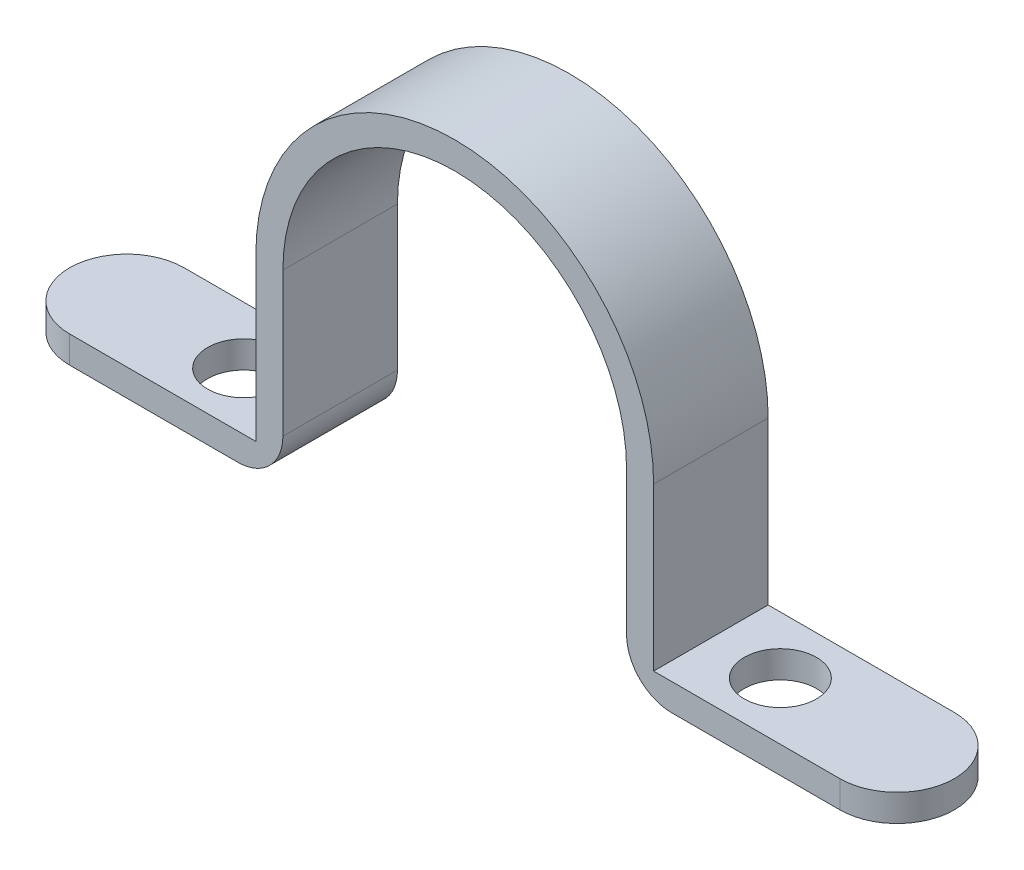
ISO-10303-21;
HEADER;
FILE_DESCRIPTION(('STEP AP214'),'2;1');
FILE_NAME('part.step','',(''),(''),'','','');
FILE_SCHEMA(('AUTOMOTIVE_DESIGN { 1 0 10303 214 1 1 1 1 }'));
ENDSEC;
DATA;
#1=APPLICATION_CONTEXT('core data for automotive mechanical design processes');
#2=APPLICATION_PROTOCOL_DEFINITION('international standard','automotive_design',2000,#1);
#3=PRODUCT_CONTEXT('',#1,'mechanical');
#4=PRODUCT('Part','Part','',(#3));
#5=PRODUCT_RELATED_PRODUCT_CATEGORY('part','',(#4));
#6=PRODUCT_DEFINITION_FORMATION('','',#4);
#7=PRODUCT_DEFINITION_CONTEXT('part definition',#1,'design');
#8=PRODUCT_DEFINITION('design','',#6,#7);
#9=PRODUCT_DEFINITION_SHAPE('','',#8);
#10=(LENGTH_UNIT() NAMED_UNIT(*) SI_UNIT(.MILLI.,.METRE.));
#11=(NAMED_UNIT(*) PLANE_ANGLE_UNIT() SI_UNIT($,.RADIAN.));
#12=(NAMED_UNIT(*) SI_UNIT($,.STERADIAN.) SOLID_ANGLE_UNIT());
#13=UNCERTAINTY_MEASURE_WITH_UNIT(LENGTH_MEASURE(1.E-05),#10,'distance_accuracy_value','');
#14=(GEOMETRIC_REPRESENTATION_CONTEXT(3) GLOBAL_UNCERTAINTY_ASSIGNED_CONTEXT((#13)) GLOBAL_UNIT_ASSIGNED_CONTEXT((#10,
#11,#12)) REPRESENTATION_CONTEXT('',''));
#15=CARTESIAN_POINT('',(0.,0.,0.));
#16=DIRECTION('',(0.,0.,1.));
#17=DIRECTION('',(1.,0.,0.));
#18=AXIS2_PLACEMENT_3D('',#15,#16,#17);
#19=CARTESIAN_POINT('',(46.529017301513,-3.,6.35));
#20=DIRECTION('',(0.,1.,0.));
#21=DIRECTION('',(0.,0.,1.));
#22=AXIS2_PLACEMENT_3D('',#19,#20,#21);
#23=CYLINDRICAL_SURFACE('',#22,6.35);
#24=DIRECTION('',(0.,-1.,0.));
#25=VECTOR('',#24,1.);
#26=CARTESIAN_POINT('',(46.529017301513,-3.,12.7));
#27=LINE('',#26,#25);
#28=CARTESIAN_POINT('',(46.529017301513,-3.,12.7));
#29=VERTEX_POINT('',#28);
#30=CARTESIAN_POINT('',(46.529017301513,0.,12.7));
#31=VERTEX_POINT('',#30);
#32=EDGE_CURVE('E147',#29,#31,#27,.F.);
#33=ORIENTED_EDGE('',*,*,#32,.F.);
#34=CARTESIAN_POINT('',(46.529017301513,-3.,6.35));
#35=DIRECTION('',(0.,1.,0.));
#36=DIRECTION('',(0.,0.,1.));
#37=AXIS2_PLACEMENT_3D('',#34,#35,#36);
#38=CIRCLE('',#37,6.35);
#39=CARTESIAN_POINT('',(46.529017301513,-3.,0.));
#40=VERTEX_POINT('',#39);
#41=EDGE_CURVE('E227',#40,#29,#38,.F.);
#42=ORIENTED_EDGE('',*,*,#41,.F.);
#43=DIRECTION('',(0.,1.,0.));
#44=VECTOR('',#43,1.);
#45=CARTESIAN_POINT('',(46.529017301513,0.,0.));
#46=LINE('',#45,#44);
#47=CARTESIAN_POINT('',(46.529017301513,0.,0.));
#48=VERTEX_POINT('',#47);
#49=EDGE_CURVE('E224',#48,#40,#46,.F.);
#50=ORIENTED_EDGE('',*,*,#49,.F.);
#51=CARTESIAN_POINT('',(46.529017301513,0.,6.35));
#52=DIRECTION('',(0.,-1.,0.));
#53=DIRECTION('',(0.,0.,-1.));
#54=AXIS2_PLACEMENT_3D('',#51,#52,#53);
#55=CIRCLE('',#54,6.35);
#56=EDGE_CURVE('E230',#31,#48,#55,.F.);
#57=ORIENTED_EDGE('',*,*,#56,.F.);
#58=EDGE_LOOP('',(#33,#42,#50,#57));
#59=FACE_BOUND('',#58,.T.);
#60=ADVANCED_FACE('F39',(#59),#23,.T.);
#61=CARTESIAN_POINT('',(-38.870982698487,0.,6.35));
#62=DIRECTION('',(0.,-1.,0.));
#63=DIRECTION('',(0.,0.,-1.));
#64=AXIS2_PLACEMENT_3D('',#61,#62,#63);
#65=CYLINDRICAL_SURFACE('',#64,6.35);
#66=DIRECTION('',(0.,1.,0.));
#67=VECTOR('',#66,1.);
#68=CARTESIAN_POINT('',(-38.870982698487,0.,12.7));
#69=LINE('',#68,#67);
#70=CARTESIAN_POINT('',(-38.870982698487,0.,12.7));
#71=VERTEX_POINT('',#70);
#72=CARTESIAN_POINT('',(-38.870982698487,-3.,12.7));
#73=VERTEX_POINT('',#72);
#74=EDGE_CURVE('E213',#71,#73,#69,.F.);
#75=ORIENTED_EDGE('',*,*,#74,.F.);
#76=CARTESIAN_POINT('',(-38.870982698487,0.,6.35));
#77=DIRECTION('',(0.,-1.,0.));
#78=DIRECTION('',(0.,0.,-1.));
#79=AXIS2_PLACEMENT_3D('',#76,#77,#78);
#80=CIRCLE('',#79,6.35);
#81=CARTESIAN_POINT('',(-38.870982698487,0.,0.));
#82=VERTEX_POINT('',#81);
#83=EDGE_CURVE('E219',#82,#71,#80,.F.);
#84=ORIENTED_EDGE('',*,*,#83,.F.);
#85=DIRECTION('',(0.,-1.,0.));
#86=VECTOR('',#85,1.);
#87=CARTESIAN_POINT('',(-38.870982698487,0.,0.));
#88=LINE('',#87,#86);
#89=CARTESIAN_POINT('',(-38.870982698487,-3.,0.));
#90=VERTEX_POINT('',#89);
#91=EDGE_CURVE('E216',#90,#82,#88,.F.);
#92=ORIENTED_EDGE('',*,*,#91,.F.);
#93=CARTESIAN_POINT('',(-38.870982698487,-3.,6.35));
#94=DIRECTION('',(0.,1.,0.));
#95=DIRECTION('',(0.,0.,1.));
#96=AXIS2_PLACEMENT_3D('',#93,#94,#95);
#97=CIRCLE('',#96,6.35);
#98=EDGE_CURVE('E221',#73,#90,#97,.F.);
#99=ORIENTED_EDGE('',*,*,#98,.F.);
#100=EDGE_LOOP('',(#75,#84,#92,#99));
#101=FACE_BOUND('',#100,.T.);
#102=ADVANCED_FACE('F257',(#101),#65,.T.);
#103=CARTESIAN_POINT('',(3.82901730151295,17.95,12.7));
#104=DIRECTION('',(0.,0.,-1.));
#105=DIRECTION('',(-1.,0.,0.));
#106=AXIS2_PLACEMENT_3D('',#103,#104,#105);
#107=CYLINDRICAL_SURFACE('',#106,22.05);
#108=DIRECTION('',(0.,0.,-1.));
#109=VECTOR('',#108,1.);
#110=CARTESIAN_POINT('',(-18.220982698487,17.95,12.7));
#111=LINE('',#110,#109);
#112=CARTESIAN_POINT('',(-18.220982698487,17.95,12.7));
#113=VERTEX_POINT('',#112);
#114=CARTESIAN_POINT('',(-18.220982698487,17.95,0.));
#115=VERTEX_POINT('',#114);
#116=EDGE_CURVE('E205',#113,#115,#111,.T.);
#117=ORIENTED_EDGE('',*,*,#116,.F.);
#118=CARTESIAN_POINT('',(3.82901730151295,17.95,12.7));
#119=DIRECTION('',(0.,0.,1.));
#120=DIRECTION('',(1.,0.,0.));
#121=AXIS2_PLACEMENT_3D('',#118,#119,#120);
#122=CIRCLE('',#121,22.05);
#123=CARTESIAN_POINT('',(25.879017301513,17.95,12.7));
#124=VERTEX_POINT('',#123);
#125=EDGE_CURVE('E209',#124,#113,#122,.T.);
#126=ORIENTED_EDGE('',*,*,#125,.F.);
#127=DIRECTION('',(0.,0.,-1.));
#128=VECTOR('',#127,1.);
#129=CARTESIAN_POINT('',(25.879017301513,17.95,12.7));
#130=LINE('',#129,#128);
#131=CARTESIAN_POINT('',(25.879017301513,17.95,0.));
#132=VERTEX_POINT('',#131);
#133=EDGE_CURVE('E165',#132,#124,#130,.F.);
#134=ORIENTED_EDGE('',*,*,#133,.F.);
#135=CARTESIAN_POINT('',(3.82901730151295,17.95,0.));
#136=DIRECTION('',(0.,0.,1.));
#137=DIRECTION('',(1.,0.,0.));
#138=AXIS2_PLACEMENT_3D('',#135,#136,#137);
#139=CIRCLE('',#138,22.05);
#140=EDGE_CURVE('E211',#115,#132,#139,.F.);
#141=ORIENTED_EDGE('',*,*,#140,.F.);
#142=EDGE_LOOP('',(#117,#126,#134,#141));
#143=FACE_BOUND('',#142,.T.);
#144=ADVANCED_FACE('F262',(#143),#107,.T.);
#145=CARTESIAN_POINT('',(3.82901730151295,17.95,0.));
#146=DIRECTION('',(0.,0.,-1.));
#147=DIRECTION('',(-1.,0.,0.));
#148=AXIS2_PLACEMENT_3D('',#145,#146,#147);
#149=CYLINDRICAL_SURFACE('',#148,19.05);
#150=DIRECTION('',(0.,0.,1.));
#151=VECTOR('',#150,1.);
#152=CARTESIAN_POINT('',(-15.220982698487,17.95,0.));
#153=LINE('',#152,#151);
#154=CARTESIAN_POINT('',(-15.220982698487,17.95,0.));
#155=VERTEX_POINT('',#154);
#156=CARTESIAN_POINT('',(-15.220982698487,17.95,12.7));
#157=VERTEX_POINT('',#156);
#158=EDGE_CURVE('E159',#155,#157,#153,.T.);
#159=ORIENTED_EDGE('',*,*,#158,.F.);
#160=CARTESIAN_POINT('',(3.82901730151295,17.95,0.));
#161=DIRECTION('',(0.,0.,1.));
#162=DIRECTION('',(1.,0.,0.));
#163=AXIS2_PLACEMENT_3D('',#160,#161,#162);
#164=CIRCLE('',#163,19.05);
#165=CARTESIAN_POINT('',(22.879017301513,17.95,0.));
#166=VERTEX_POINT('',#165);
#167=EDGE_CURVE('E200',#155,#166,#164,.F.);
#168=ORIENTED_EDGE('',*,*,#167,.T.);
#169=DIRECTION('',(0.,0.,1.));
#170=VECTOR('',#169,1.);
#171=CARTESIAN_POINT('',(22.8790173015129,17.95,0.));
#172=LINE('',#171,#170);
#173=CARTESIAN_POINT('',(22.879017301513,17.95,12.7));
#174=VERTEX_POINT('',#173);
#175=EDGE_CURVE('E197',#174,#166,#172,.F.);
#176=ORIENTED_EDGE('',*,*,#175,.F.);
#177=CARTESIAN_POINT('',(3.82901730151295,17.95,12.7));
#178=DIRECTION('',(0.,0.,1.));
#179=DIRECTION('',(1.,0.,0.));
#180=AXIS2_PLACEMENT_3D('',#177,#178,#179);
#181=CIRCLE('',#180,19.05);
#182=EDGE_CURVE('E202',#174,#157,#181,.T.);
#183=ORIENTED_EDGE('',*,*,#182,.T.);
#184=EDGE_LOOP('',(#159,#168,#176,#183));
#185=FACE_BOUND('',#184,.T.);
#186=ADVANCED_FACE('F332',(#185),#149,.F.);
#187=CARTESIAN_POINT('',(-45.220982698487,-3.,12.7));
#188=DIRECTION('',(0.,1.,0.));
#189=DIRECTION('',(0.,0.,1.));
#190=AXIS2_PLACEMENT_3D('',#187,#188,#189);
#191=PLANE('',#190);
#192=CARTESIAN_POINT('',(-25.920982698487,-3.,6.35));
#193=DIRECTION('',(0.,1.,0.));
#194=DIRECTION('',(0.,0.,1.));
#195=AXIS2_PLACEMENT_3D('',#192,#193,#194);
#196=CIRCLE('',#195,4.);
#197=CARTESIAN_POINT('',(-25.920982698487,-3.,10.35));
#198=VERTEX_POINT('',#197);
#199=EDGE_CURVE('E178',#198,#198,#196,.T.);
#200=ORIENTED_EDGE('',*,*,#199,.T.);
#201=EDGE_LOOP('',(#200));
#202=FACE_BOUND('',#201,.T.);
#203=DIRECTION('',(1.,0.,0.));
#204=VECTOR('',#203,1.);
#205=CARTESIAN_POINT('',(-45.220982698487,-3.,0.));
#206=LINE('',#205,#204);
#207=CARTESIAN_POINT('',(-20.220982698487,-3.,0.));
#208=VERTEX_POINT('',#207);
#209=EDGE_CURVE('E174',#90,#208,#206,.T.);
#210=ORIENTED_EDGE('',*,*,#209,.T.);
#211=DIRECTION('',(0.,0.,-1.));
#212=VECTOR('',#211,1.);
#213=CARTESIAN_POINT('',(-20.220982698487,-3.,12.7));
#214=LINE('',#213,#212);
#215=CARTESIAN_POINT('',(-20.220982698487,-3.,12.7));
#216=VERTEX_POINT('',#215);
#217=EDGE_CURVE('E239',#208,#216,#214,.F.);
#218=ORIENTED_EDGE('',*,*,#217,.T.);
#219=DIRECTION('',(1.,0.,0.));
#220=VECTOR('',#219,1.);
#221=CARTESIAN_POINT('',(-45.220982698487,-3.,12.7));
#222=LINE('',#221,#220);
#223=EDGE_CURVE('E192',#73,#216,#222,.T.);
#224=ORIENTED_EDGE('',*,*,#223,.F.);
#225=ORIENTED_EDGE('',*,*,#98,.T.);
#226=EDGE_LOOP('',(#210,#218,#224,#225));
#227=FACE_BOUND('',#226,.T.);
#228=ADVANCED_FACE('F307',(#202,#227),#191,.F.);
#229=CARTESIAN_POINT('',(-15.220982698487,-3.,12.7));
#230=DIRECTION('',(-1.,0.,0.));
#231=DIRECTION('',(0.,0.,1.));
#232=AXIS2_PLACEMENT_3D('',#229,#230,#231);
#233=PLANE('',#232);
#234=DIRECTION('',(0.,1.,0.));
#235=VECTOR('',#234,1.);
#236=CARTESIAN_POINT('',(-15.220982698487,-3.,12.7));
#237=LINE('',#236,#235);
#238=CARTESIAN_POINT('',(-15.220982698487,2.,12.7));
#239=VERTEX_POINT('',#238);
#240=EDGE_CURVE('E285',#239,#157,#237,.T.);
#241=ORIENTED_EDGE('',*,*,#240,.F.);
#242=DIRECTION('',(0.,0.,-1.));
#243=VECTOR('',#242,1.);
#244=CARTESIAN_POINT('',(-15.220982698487,2.,12.7));
#245=LINE('',#244,#243);
#246=CARTESIAN_POINT('',(-15.220982698487,2.,0.));
#247=VERTEX_POINT('',#246);
#248=EDGE_CURVE('E232',#239,#247,#245,.T.);
#249=ORIENTED_EDGE('',*,*,#248,.T.);
#250=DIRECTION('',(0.,1.,0.));
#251=VECTOR('',#250,1.);
#252=CARTESIAN_POINT('',(-15.220982698487,-3.,0.));
#253=LINE('',#252,#251);
#254=EDGE_CURVE('E177',#247,#155,#253,.T.);
#255=ORIENTED_EDGE('',*,*,#254,.T.);
#256=ORIENTED_EDGE('',*,*,#158,.T.);
#257=EDGE_LOOP('',(#241,#249,#255,#256));
#258=FACE_BOUND('',#257,.T.);
#259=ADVANCED_FACE('F288',(#258),#233,.F.);
#260=CARTESIAN_POINT('',(22.879017301513,37.,12.7));
#261=DIRECTION('',(1.,0.,0.));
#262=DIRECTION('',(0.,1.,0.));
#263=AXIS2_PLACEMENT_3D('',#260,#261,#262);
#264=PLANE('',#263);
#265=DIRECTION('',(0.,-1.,0.));
#266=VECTOR('',#265,1.);
#267=CARTESIAN_POINT('',(22.879017301513,37.,0.));
#268=LINE('',#267,#266);
#269=CARTESIAN_POINT('',(22.879017301513,2.,0.));
#270=VERTEX_POINT('',#269);
#271=EDGE_CURVE('E180',#166,#270,#268,.T.);
#272=ORIENTED_EDGE('',*,*,#271,.T.);
#273=DIRECTION('',(0.,0.,-1.));
#274=VECTOR('',#273,1.);
#275=CARTESIAN_POINT('',(22.879017301513,2.,12.7));
#276=LINE('',#275,#274);
#277=CARTESIAN_POINT('',(22.879017301513,2.,12.7));
#278=VERTEX_POINT('',#277);
#279=EDGE_CURVE('E11',#270,#278,#276,.F.);
#280=ORIENTED_EDGE('',*,*,#279,.T.);
#281=DIRECTION('',(0.,-1.,0.));
#282=VECTOR('',#281,1.);
#283=CARTESIAN_POINT('',(22.879017301513,37.,12.7));
#284=LINE('',#283,#282);
#285=EDGE_CURVE('E290',#174,#278,#284,.T.);
#286=ORIENTED_EDGE('',*,*,#285,.F.);
#287=ORIENTED_EDGE('',*,*,#175,.T.);
#288=EDGE_LOOP('',(#272,#280,#286,#287));
#289=FACE_BOUND('',#288,.T.);
#290=ADVANCED_FACE('F349',(#289),#264,.F.);
#291=CARTESIAN_POINT('',(22.879017301513,-3.,12.7));
#292=DIRECTION('',(0.,1.,0.));
#293=DIRECTION('',(0.,0.,1.));
#294=AXIS2_PLACEMENT_3D('',#291,#292,#293);
#295=PLANE('',#294);
#296=CARTESIAN_POINT('',(33.579017301513,-3.,6.35));
#297=DIRECTION('',(0.,1.,0.));
#298=DIRECTION('',(0.,0.,1.));
#299=AXIS2_PLACEMENT_3D('',#296,#297,#298);
#300=CIRCLE('',#299,4.00000000000001);
#301=CARTESIAN_POINT('',(33.579017301513,-3.,10.35));
#302=VERTEX_POINT('',#301);
#303=EDGE_CURVE('E298',#302,#302,#300,.T.);
#304=ORIENTED_EDGE('',*,*,#303,.T.);
#305=EDGE_LOOP('',(#304));
#306=FACE_BOUND('',#305,.T.);
#307=DIRECTION('',(1.,0.,0.));
#308=VECTOR('',#307,1.);
#309=CARTESIAN_POINT('',(22.879017301513,-3.,12.7));
#310=LINE('',#309,#308);
#311=CARTESIAN_POINT('',(27.879017301513,-3.,12.7));
#312=VERTEX_POINT('',#311);
#313=EDGE_CURVE('E149',#312,#29,#310,.T.);
#314=ORIENTED_EDGE('',*,*,#313,.F.);
#315=DIRECTION('',(0.,0.,-1.));
#316=VECTOR('',#315,1.);
#317=CARTESIAN_POINT('',(27.879017301513,-3.,12.7));
#318=LINE('',#317,#316);
#319=CARTESIAN_POINT('',(27.879017301513,-3.,0.));
#320=VERTEX_POINT('',#319);
#321=EDGE_CURVE('E47',#312,#320,#318,.T.);
#322=ORIENTED_EDGE('',*,*,#321,.T.);
#323=DIRECTION('',(1.,0.,0.));
#324=VECTOR('',#323,1.);
#325=CARTESIAN_POINT('',(22.879017301513,-3.,0.));
#326=LINE('',#325,#324);
#327=EDGE_CURVE('E182',#320,#40,#326,.T.);
#328=ORIENTED_EDGE('',*,*,#327,.T.);
#329=ORIENTED_EDGE('',*,*,#41,.T.);
#330=EDGE_LOOP('',(#314,#322,#328,#329));
#331=FACE_BOUND('',#330,.T.);
#332=ADVANCED_FACE('F247',(#306,#331),#295,.F.);
#333=CARTESIAN_POINT('',(25.879017301513,0.,12.7));
#334=DIRECTION('',(0.,-1.,0.));
#335=DIRECTION('',(0.,0.,-1.));
#336=AXIS2_PLACEMENT_3D('',#333,#334,#335);
#337=PLANE('',#336);
#338=CARTESIAN_POINT('',(33.579017301513,0.,6.35));
#339=DIRECTION('',(0.,1.,0.));
#340=DIRECTION('',(0.,0.,1.));
#341=AXIS2_PLACEMENT_3D('',#338,#339,#340);
#342=CIRCLE('',#341,4.00000000000001);
#343=CARTESIAN_POINT('',(33.579017301513,0.,10.35));
#344=VERTEX_POINT('',#343);
#345=EDGE_CURVE('E295',#344,#344,#342,.T.);
#346=ORIENTED_EDGE('',*,*,#345,.F.);
#347=EDGE_LOOP('',(#346));
#348=FACE_BOUND('',#347,.T.);
#349=DIRECTION('',(-1.,0.,0.));
#350=VECTOR('',#349,1.);
#351=CARTESIAN_POINT('',(25.879017301513,0.,12.7));
#352=LINE('',#351,#350);
#353=CARTESIAN_POINT('',(25.879017301513,0.,12.7));
#354=VERTEX_POINT('',#353);
#355=EDGE_CURVE('E140',#31,#354,#352,.T.);
#356=ORIENTED_EDGE('',*,*,#355,.F.);
#357=ORIENTED_EDGE('',*,*,#56,.T.);
#358=DIRECTION('',(-1.,0.,0.));
#359=VECTOR('',#358,1.);
#360=CARTESIAN_POINT('',(25.879017301513,0.,0.));
#361=LINE('',#360,#359);
#362=CARTESIAN_POINT('',(25.879017301513,0.,0.));
#363=VERTEX_POINT('',#362);
#364=EDGE_CURVE('E155',#48,#363,#361,.T.);
#365=ORIENTED_EDGE('',*,*,#364,.T.);
#366=DIRECTION('',(0.,0.,-1.));
#367=VECTOR('',#366,1.);
#368=CARTESIAN_POINT('',(25.879017301513,0.,12.7));
#369=LINE('',#368,#367);
#370=EDGE_CURVE('E152',#354,#363,#369,.T.);
#371=ORIENTED_EDGE('',*,*,#370,.F.);
#372=EDGE_LOOP('',(#356,#357,#365,#371));
#373=FACE_BOUND('',#372,.T.);
#374=ADVANCED_FACE('F153',(#348,#373),#337,.F.);
#375=CARTESIAN_POINT('',(25.879017301513,40.,12.7));
#376=DIRECTION('',(-1.,0.,0.));
#377=DIRECTION('',(0.,0.,1.));
#378=AXIS2_PLACEMENT_3D('',#375,#376,#377);
#379=PLANE('',#378);
#380=DIRECTION('',(0.,1.,0.));
#381=VECTOR('',#380,1.);
#382=CARTESIAN_POINT('',(25.879017301513,40.,0.));
#383=LINE('',#382,#381);
#384=EDGE_CURVE('E185',#363,#132,#383,.T.);
#385=ORIENTED_EDGE('',*,*,#384,.T.);
#386=ORIENTED_EDGE('',*,*,#133,.T.);
#387=DIRECTION('',(0.,1.,0.));
#388=VECTOR('',#387,1.);
#389=CARTESIAN_POINT('',(25.879017301513,40.,12.7));
#390=LINE('',#389,#388);
#391=EDGE_CURVE('E145',#354,#124,#390,.T.);
#392=ORIENTED_EDGE('',*,*,#391,.F.);
#393=ORIENTED_EDGE('',*,*,#370,.T.);
#394=EDGE_LOOP('',(#385,#386,#392,#393));
#395=FACE_BOUND('',#394,.T.);
#396=ADVANCED_FACE('F163',(#395),#379,.F.);
#397=CARTESIAN_POINT('',(-18.220982698487,0.,12.7));
#398=DIRECTION('',(1.,0.,0.));
#399=DIRECTION('',(0.,0.,-1.));
#400=AXIS2_PLACEMENT_3D('',#397,#398,#399);
#401=PLANE('',#400);
#402=DIRECTION('',(0.,-1.,0.));
#403=VECTOR('',#402,1.);
#404=CARTESIAN_POINT('',(-18.220982698487,0.,12.7));
#405=LINE('',#404,#403);
#406=CARTESIAN_POINT('',(-18.220982698487,0.,12.7));
#407=VERTEX_POINT('',#406);
#408=EDGE_CURVE('E166',#113,#407,#405,.T.);
#409=ORIENTED_EDGE('',*,*,#408,.F.);
#410=ORIENTED_EDGE('',*,*,#116,.T.);
#411=DIRECTION('',(0.,-1.,0.));
#412=VECTOR('',#411,1.);
#413=CARTESIAN_POINT('',(-18.220982698487,0.,0.));
#414=LINE('',#413,#412);
#415=CARTESIAN_POINT('',(-18.220982698487,0.,0.));
#416=VERTEX_POINT('',#415);
#417=EDGE_CURVE('E187',#115,#416,#414,.T.);
#418=ORIENTED_EDGE('',*,*,#417,.T.);
#419=DIRECTION('',(0.,0.,-1.));
#420=VECTOR('',#419,1.);
#421=CARTESIAN_POINT('',(-18.220982698487,0.,12.7));
#422=LINE('',#421,#420);
#423=EDGE_CURVE('E160',#407,#416,#422,.T.);
#424=ORIENTED_EDGE('',*,*,#423,.F.);
#425=EDGE_LOOP('',(#409,#410,#418,#424));
#426=FACE_BOUND('',#425,.T.);
#427=ADVANCED_FACE('F318',(#426),#401,.F.);
#428=CARTESIAN_POINT('',(-45.220982698487,0.,12.7));
#429=DIRECTION('',(0.,-1.,0.));
#430=DIRECTION('',(0.,0.,-1.));
#431=AXIS2_PLACEMENT_3D('',#428,#429,#430);
#432=PLANE('',#431);
#433=CARTESIAN_POINT('',(-25.920982698487,0.,6.35));
#434=DIRECTION('',(0.,1.,0.));
#435=DIRECTION('',(0.,0.,1.));
#436=AXIS2_PLACEMENT_3D('',#433,#434,#435);
#437=CIRCLE('',#436,4.);
#438=CARTESIAN_POINT('',(-25.920982698487,0.,10.35));
#439=VERTEX_POINT('',#438);
#440=EDGE_CURVE('E301',#439,#439,#437,.T.);
#441=ORIENTED_EDGE('',*,*,#440,.F.);
#442=EDGE_LOOP('',(#441));
#443=FACE_BOUND('',#442,.T.);
#444=DIRECTION('',(-1.,0.,0.));
#445=VECTOR('',#444,1.);
#446=CARTESIAN_POINT('',(-45.220982698487,0.,0.));
#447=LINE('',#446,#445);
#448=EDGE_CURVE('E189',#416,#82,#447,.T.);
#449=ORIENTED_EDGE('',*,*,#448,.T.);
#450=ORIENTED_EDGE('',*,*,#83,.T.);
#451=DIRECTION('',(-1.,0.,0.));
#452=VECTOR('',#451,1.);
#453=CARTESIAN_POINT('',(-45.220982698487,0.,12.7));
#454=LINE('',#453,#452);
#455=EDGE_CURVE('E168',#407,#71,#454,.T.);
#456=ORIENTED_EDGE('',*,*,#455,.F.);
#457=ORIENTED_EDGE('',*,*,#423,.T.);
#458=EDGE_LOOP('',(#449,#450,#456,#457));
#459=FACE_BOUND('',#458,.T.);
#460=ADVANCED_FACE('F315',(#443,#459),#432,.F.);
#461=CARTESIAN_POINT('',(0.,0.,12.7));
#462=DIRECTION('',(0.,0.,1.));
#463=DIRECTION('',(1.,0.,0.));
#464=AXIS2_PLACEMENT_3D('',#461,#462,#463);
#465=PLANE('',#464);
#466=ORIENTED_EDGE('',*,*,#223,.T.);
#467=CARTESIAN_POINT('',(-20.220982698487,2.,12.7));
#468=DIRECTION('',(0.,0.,1.));
#469=DIRECTION('',(1.,0.,0.));
#470=AXIS2_PLACEMENT_3D('',#467,#468,#469);
#471=CIRCLE('',#470,5.);
#472=EDGE_CURVE('E242',#216,#239,#471,.T.);
#473=ORIENTED_EDGE('',*,*,#472,.T.);
#474=ORIENTED_EDGE('',*,*,#240,.T.);
#475=ORIENTED_EDGE('',*,*,#182,.F.);
#476=ORIENTED_EDGE('',*,*,#285,.T.);
#477=CARTESIAN_POINT('',(27.879017301513,2.,12.7));
#478=DIRECTION('',(0.,0.,1.));
#479=DIRECTION('',(1.,0.,0.));
#480=AXIS2_PLACEMENT_3D('',#477,#478,#479);
#481=CIRCLE('',#480,5.);
#482=EDGE_CURVE('E59',#278,#312,#481,.T.);
#483=ORIENTED_EDGE('',*,*,#482,.T.);
#484=ORIENTED_EDGE('',*,*,#313,.T.);
#485=ORIENTED_EDGE('',*,*,#32,.T.);
#486=ORIENTED_EDGE('',*,*,#355,.T.);
#487=ORIENTED_EDGE('',*,*,#391,.T.);
#488=ORIENTED_EDGE('',*,*,#125,.T.);
#489=ORIENTED_EDGE('',*,*,#408,.T.);
#490=ORIENTED_EDGE('',*,*,#455,.T.);
#491=ORIENTED_EDGE('',*,*,#74,.T.);
#492=EDGE_LOOP('',(#466,#473,#474,#475,#476,#483,#484,#485,#486,#487,#488,#489,#490,#491));
#493=FACE_BOUND('',#492,.T.);
#494=ADVANCED_FACE('F143',(#493),#465,.T.);
#495=CARTESIAN_POINT('',(0.,0.,0.));
#496=DIRECTION('',(0.,0.,1.));
#497=DIRECTION('',(1.,0.,0.));
#498=AXIS2_PLACEMENT_3D('',#495,#496,#497);
#499=PLANE('',#498);
#500=ORIENTED_EDGE('',*,*,#254,.F.);
#501=CARTESIAN_POINT('',(-20.220982698487,2.,0.));
#502=DIRECTION('',(0.,0.,1.));
#503=DIRECTION('',(1.,0.,0.));
#504=AXIS2_PLACEMENT_3D('',#501,#502,#503);
#505=CIRCLE('',#504,5.);
#506=EDGE_CURVE('E237',#247,#208,#505,.F.);
#507=ORIENTED_EDGE('',*,*,#506,.T.);
#508=ORIENTED_EDGE('',*,*,#209,.F.);
#509=ORIENTED_EDGE('',*,*,#91,.T.);
#510=ORIENTED_EDGE('',*,*,#448,.F.);
#511=ORIENTED_EDGE('',*,*,#417,.F.);
#512=ORIENTED_EDGE('',*,*,#140,.T.);
#513=ORIENTED_EDGE('',*,*,#384,.F.);
#514=ORIENTED_EDGE('',*,*,#364,.F.);
#515=ORIENTED_EDGE('',*,*,#49,.T.);
#516=ORIENTED_EDGE('',*,*,#327,.F.);
#517=CARTESIAN_POINT('',(27.879017301513,2.,0.));
#518=DIRECTION('',(0.,0.,1.));
#519=DIRECTION('',(1.,0.,0.));
#520=AXIS2_PLACEMENT_3D('',#517,#518,#519);
#521=CIRCLE('',#520,5.);
#522=EDGE_CURVE('E235',#320,#270,#521,.F.);
#523=ORIENTED_EDGE('',*,*,#522,.T.);
#524=ORIENTED_EDGE('',*,*,#271,.F.);
#525=ORIENTED_EDGE('',*,*,#167,.F.);
#526=EDGE_LOOP('',(#500,#507,#508,#509,#510,#511,#512,#513,#514,#515,#516,#523,#524,#525));
#527=FACE_BOUND('',#526,.T.);
#528=ADVANCED_FACE('F252',(#527),#499,.F.);
#529=CARTESIAN_POINT('',(-25.920982698487,-3.,6.35));
#530=DIRECTION('',(0.,1.,0.));
#531=DIRECTION('',(0.,0.,1.));
#532=AXIS2_PLACEMENT_3D('',#529,#530,#531);
#533=CYLINDRICAL_SURFACE('',#532,4.);
#534=ORIENTED_EDGE('',*,*,#199,.F.);
#535=EDGE_LOOP('',(#534));
#536=FACE_BOUND('',#535,.T.);
#537=ORIENTED_EDGE('',*,*,#440,.T.);
#538=EDGE_LOOP('',(#537));
#539=FACE_BOUND('',#538,.T.);
#540=ADVANCED_FACE('F278',(#536,#539),#533,.F.);
#541=CARTESIAN_POINT('',(33.579017301513,-3.,6.35));
#542=DIRECTION('',(0.,1.,0.));
#543=DIRECTION('',(0.,0.,1.));
#544=AXIS2_PLACEMENT_3D('',#541,#542,#543);
#545=CYLINDRICAL_SURFACE('',#544,4.00000000000001);
#546=ORIENTED_EDGE('',*,*,#303,.F.);
#547=EDGE_LOOP('',(#546));
#548=FACE_BOUND('',#547,.T.);
#549=ORIENTED_EDGE('',*,*,#345,.T.);
#550=EDGE_LOOP('',(#549));
#551=FACE_BOUND('',#550,.T.);
#552=ADVANCED_FACE('F272',(#548,#551),#545,.F.);
#553=CARTESIAN_POINT('',(-20.220982698487,2.,12.7));
#554=DIRECTION('',(0.,0.,-1.));
#555=DIRECTION('',(-1.,0.,0.));
#556=AXIS2_PLACEMENT_3D('',#553,#554,#555);
#557=CYLINDRICAL_SURFACE('',#556,5.);
#558=ORIENTED_EDGE('',*,*,#472,.F.);
#559=ORIENTED_EDGE('',*,*,#217,.F.);
#560=ORIENTED_EDGE('',*,*,#506,.F.);
#561=ORIENTED_EDGE('',*,*,#248,.F.);
#562=EDGE_LOOP('',(#558,#559,#560,#561));
#563=FACE_BOUND('',#562,.T.);
#564=ADVANCED_FACE('F270',(#563),#557,.T.);
#565=CARTESIAN_POINT('',(27.879017301513,2.,12.7));
#566=DIRECTION('',(0.,0.,-1.));
#567=DIRECTION('',(-1.,0.,0.));
#568=AXIS2_PLACEMENT_3D('',#565,#566,#567);
#569=CYLINDRICAL_SURFACE('',#568,5.);
#570=ORIENTED_EDGE('',*,*,#482,.F.);
#571=ORIENTED_EDGE('',*,*,#279,.F.);
#572=ORIENTED_EDGE('',*,*,#522,.F.);
#573=ORIENTED_EDGE('',*,*,#321,.F.);
#574=EDGE_LOOP('',(#570,#571,#572,#573));
#575=FACE_BOUND('',#574,.T.);
#576=ADVANCED_FACE('F41',(#575),#569,.T.);
#577=CLOSED_SHELL('',(#60,#102,#144,#186,#228,#259,#290,#332,#374,#396,#427,#460,#494,#528,#540,
#552,#564,#576));
#578=MANIFOLD_SOLID_BREP('B2',#577);
#579=ADVANCED_BREP_SHAPE_REPRESENTATION('',(#18,#578),#14);
#580=SHAPE_DEFINITION_REPRESENTATION(#9,#579);
ENDSEC;
END-ISO-10303-21;
